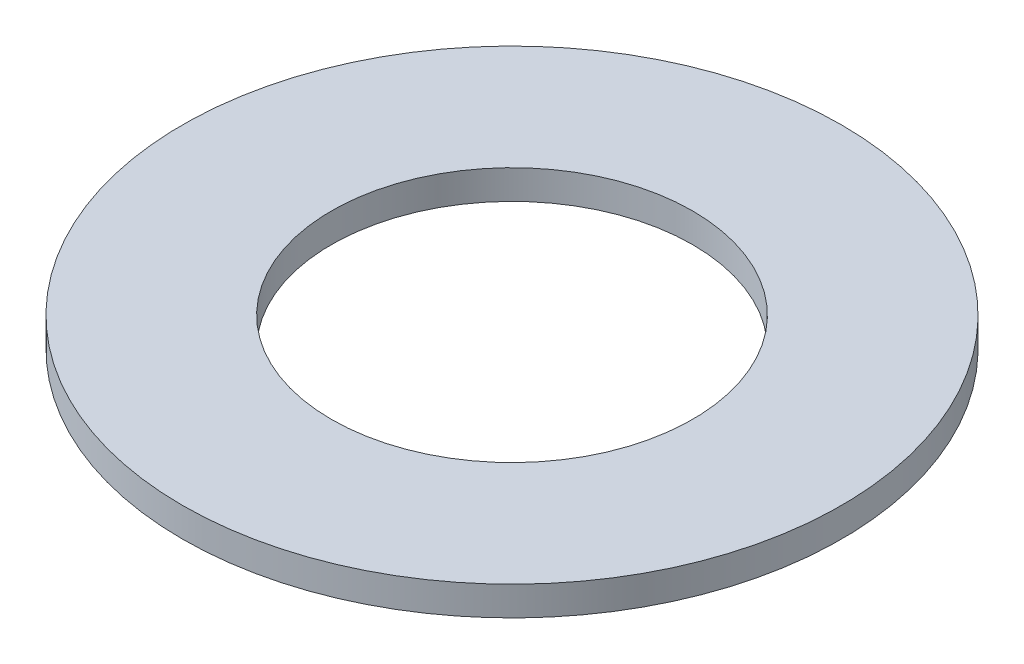
ISO-10303-21;
HEADER;
FILE_DESCRIPTION(('STEP AP214'),'2;1');
FILE_NAME('part.step','',(''),(''),'','','');
FILE_SCHEMA(('AUTOMOTIVE_DESIGN { 1 0 10303 214 1 1 1 1 }'));
ENDSEC;
DATA;
#1=APPLICATION_CONTEXT('core data for automotive mechanical design processes');
#2=APPLICATION_PROTOCOL_DEFINITION('international standard','automotive_design',2000,#1);
#3=PRODUCT_CONTEXT('',#1,'mechanical');
#4=PRODUCT('Part','Part','',(#3));
#5=PRODUCT_RELATED_PRODUCT_CATEGORY('part','',(#4));
#6=PRODUCT_DEFINITION_FORMATION('','',#4);
#7=PRODUCT_DEFINITION_CONTEXT('part definition',#1,'design');
#8=PRODUCT_DEFINITION('design','',#6,#7);
#9=PRODUCT_DEFINITION_SHAPE('','',#8);
#10=(LENGTH_UNIT() NAMED_UNIT(*) SI_UNIT(.MILLI.,.METRE.));
#11=(NAMED_UNIT(*) PLANE_ANGLE_UNIT() SI_UNIT($,.RADIAN.));
#12=(NAMED_UNIT(*) SI_UNIT($,.STERADIAN.) SOLID_ANGLE_UNIT());
#13=UNCERTAINTY_MEASURE_WITH_UNIT(LENGTH_MEASURE(1.E-05),#10,'distance_accuracy_value','');
#14=(GEOMETRIC_REPRESENTATION_CONTEXT(3) GLOBAL_UNCERTAINTY_ASSIGNED_CONTEXT((#13)) GLOBAL_UNIT_ASSIGNED_CONTEXT((#10,
#11,#12)) REPRESENTATION_CONTEXT('',''));
#15=CARTESIAN_POINT('',(0.,0.,0.));
#16=DIRECTION('',(0.,0.,1.));
#17=DIRECTION('',(1.,0.,0.));
#18=AXIS2_PLACEMENT_3D('',#15,#16,#17);
#19=CARTESIAN_POINT('',(0.,3.3782,0.));
#20=DIRECTION('',(0.,1.,0.));
#21=DIRECTION('',(0.,0.,1.));
#22=AXIS2_PLACEMENT_3D('',#19,#20,#21);
#23=PLANE('',#22);
#24=CARTESIAN_POINT('',(0.,3.3782,0.));
#25=DIRECTION('',(0.,1.,0.));
#26=DIRECTION('',(0.,0.,1.));
#27=AXIS2_PLACEMENT_3D('',#24,#25,#26);
#28=CIRCLE('',#27,38.1);
#29=CARTESIAN_POINT('',(0.,3.3782,38.1));
#30=VERTEX_POINT('',#29);
#31=EDGE_CURVE('E10',#30,#30,#28,.T.);
#32=ORIENTED_EDGE('',*,*,#31,.T.);
#33=EDGE_LOOP('',(#32));
#34=FACE_BOUND('',#33,.T.);
#35=CARTESIAN_POINT('',(0.,3.3782,0.));
#36=DIRECTION('',(0.,1.,0.));
#37=DIRECTION('',(0.,0.,1.));
#38=AXIS2_PLACEMENT_3D('',#35,#36,#37);
#39=CIRCLE('',#38,20.8788);
#40=CARTESIAN_POINT('',(0.,3.3782,20.8788));
#41=VERTEX_POINT('',#40);
#42=EDGE_CURVE('E46',#41,#41,#39,.T.);
#43=ORIENTED_EDGE('',*,*,#42,.F.);
#44=EDGE_LOOP('',(#43));
#45=FACE_BOUND('',#44,.T.);
#46=ADVANCED_FACE('F35',(#34,#45),#23,.T.);
#47=CARTESIAN_POINT('',(0.,0.,0.));
#48=DIRECTION('',(0.,1.,0.));
#49=DIRECTION('',(0.,0.,1.));
#50=AXIS2_PLACEMENT_3D('',#47,#48,#49);
#51=PLANE('',#50);
#52=CARTESIAN_POINT('',(0.,0.,0.));
#53=DIRECTION('',(0.,1.,0.));
#54=DIRECTION('',(0.,0.,1.));
#55=AXIS2_PLACEMENT_3D('',#52,#53,#54);
#56=CIRCLE('',#55,38.1);
#57=CARTESIAN_POINT('',(0.,0.,38.1));
#58=VERTEX_POINT('',#57);
#59=EDGE_CURVE('E39',#58,#58,#56,.T.);
#60=ORIENTED_EDGE('',*,*,#59,.F.);
#61=EDGE_LOOP('',(#60));
#62=FACE_BOUND('',#61,.T.);
#63=CARTESIAN_POINT('',(0.,0.,0.));
#64=DIRECTION('',(0.,1.,0.));
#65=DIRECTION('',(0.,0.,1.));
#66=AXIS2_PLACEMENT_3D('',#63,#64,#65);
#67=CIRCLE('',#66,20.8788);
#68=CARTESIAN_POINT('',(0.,0.,20.8788));
#69=VERTEX_POINT('',#68);
#70=EDGE_CURVE('E48',#69,#69,#67,.T.);
#71=ORIENTED_EDGE('',*,*,#70,.T.);
#72=EDGE_LOOP('',(#71));
#73=FACE_BOUND('',#72,.T.);
#74=ADVANCED_FACE('F58',(#62,#73),#51,.F.);
#75=CARTESIAN_POINT('',(0.,3.3782,0.));
#76=DIRECTION('',(0.,-1.,0.));
#77=DIRECTION('',(0.,0.,-1.));
#78=AXIS2_PLACEMENT_3D('',#75,#76,#77);
#79=CYLINDRICAL_SURFACE('',#78,38.1);
#80=ORIENTED_EDGE('',*,*,#31,.F.);
#81=EDGE_LOOP('',(#80));
#82=FACE_BOUND('',#81,.T.);
#83=ORIENTED_EDGE('',*,*,#59,.T.);
#84=EDGE_LOOP('',(#83));
#85=FACE_BOUND('',#84,.T.);
#86=ADVANCED_FACE('F37',(#82,#85),#79,.T.);
#87=CARTESIAN_POINT('',(0.,3.3782,0.));
#88=DIRECTION('',(0.,-1.,0.));
#89=DIRECTION('',(0.,0.,-1.));
#90=AXIS2_PLACEMENT_3D('',#87,#88,#89);
#91=CYLINDRICAL_SURFACE('',#90,20.8788);
#92=ORIENTED_EDGE('',*,*,#42,.T.);
#93=EDGE_LOOP('',(#92));
#94=FACE_BOUND('',#93,.T.);
#95=ORIENTED_EDGE('',*,*,#70,.F.);
#96=EDGE_LOOP('',(#95));
#97=FACE_BOUND('',#96,.T.);
#98=ADVANCED_FACE('F54',(#94,#97),#91,.F.);
#99=CLOSED_SHELL('',(#46,#74,#86,#98));
#100=MANIFOLD_SOLID_BREP('B2',#99);
#101=ADVANCED_BREP_SHAPE_REPRESENTATION('',(#18,#100),#14);
#102=SHAPE_DEFINITION_REPRESENTATION(#9,#101);
ENDSEC;
END-ISO-10303-21;
